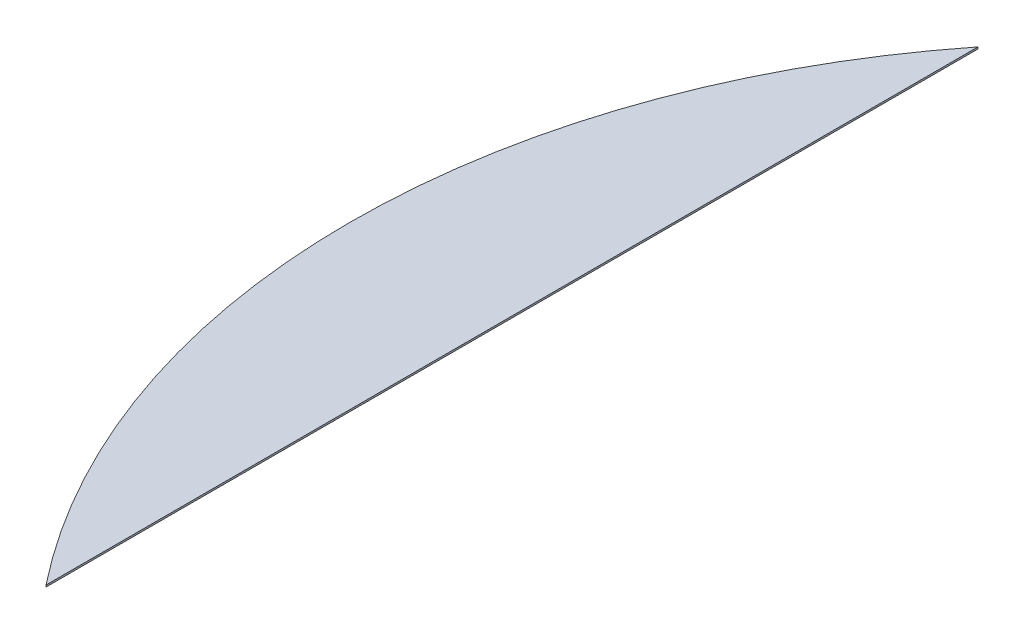
ISO-10303-21;
HEADER;
FILE_DESCRIPTION(('STEP AP214'),'2;1');
FILE_NAME('part.step','',(''),(''),'','','');
FILE_SCHEMA(('AUTOMOTIVE_DESIGN { 1 0 10303 214 1 1 1 1 }'));
ENDSEC;
DATA;
#1=APPLICATION_CONTEXT('core data for automotive mechanical design processes');
#2=APPLICATION_PROTOCOL_DEFINITION('international standard','automotive_design',2000,#1);
#3=PRODUCT_CONTEXT('',#1,'mechanical');
#4=PRODUCT('Part','Part','',(#3));
#5=PRODUCT_RELATED_PRODUCT_CATEGORY('part','',(#4));
#6=PRODUCT_DEFINITION_FORMATION('','',#4);
#7=PRODUCT_DEFINITION_CONTEXT('part definition',#1,'design');
#8=PRODUCT_DEFINITION('design','',#6,#7);
#9=PRODUCT_DEFINITION_SHAPE('','',#8);
#10=(LENGTH_UNIT() NAMED_UNIT(*) SI_UNIT(.MILLI.,.METRE.));
#11=(NAMED_UNIT(*) PLANE_ANGLE_UNIT() SI_UNIT($,.RADIAN.));
#12=(NAMED_UNIT(*) SI_UNIT($,.STERADIAN.) SOLID_ANGLE_UNIT());
#13=UNCERTAINTY_MEASURE_WITH_UNIT(LENGTH_MEASURE(1.E-05),#10,'distance_accuracy_value','');
#14=(GEOMETRIC_REPRESENTATION_CONTEXT(3) GLOBAL_UNCERTAINTY_ASSIGNED_CONTEXT((#13)) GLOBAL_UNIT_ASSIGNED_CONTEXT((#10,
#11,#12)) REPRESENTATION_CONTEXT('',''));
#15=CARTESIAN_POINT('',(0.,0.,0.));
#16=DIRECTION('',(0.,0.,1.));
#17=DIRECTION('',(1.,0.,0.));
#18=AXIS2_PLACEMENT_3D('',#15,#16,#17);
#19=CARTESIAN_POINT('',(0.,1095.,0.));
#20=DIRECTION('',(0.,-1.,0.));
#21=DIRECTION('',(0.,0.,-1.));
#22=AXIS2_PLACEMENT_3D('',#19,#20,#21);
#23=CYLINDRICAL_SURFACE('',#22,824.);
#24=CARTESIAN_POINT('',(0.,1093.,0.));
#25=DIRECTION('',(0.,1.,0.));
#26=DIRECTION('',(0.,0.,1.));
#27=AXIS2_PLACEMENT_3D('',#24,#25,#26);
#28=CIRCLE('',#27,824.);
#29=CARTESIAN_POINT('',(-646.,1093.,-511.527125380463));
#30=VERTEX_POINT('',#29);
#31=CARTESIAN_POINT('',(-646.,1093.,511.527125380463));
#32=VERTEX_POINT('',#31);
#33=EDGE_CURVE('E73',#30,#32,#28,.T.);
#34=ORIENTED_EDGE('',*,*,#33,.T.);
#35=DIRECTION('',(0.,-1.,0.));
#36=VECTOR('',#35,1.);
#37=CARTESIAN_POINT('',(-646.,1095.,511.527125380463));
#38=LINE('',#37,#36);
#39=CARTESIAN_POINT('',(-646.,1095.,511.527125380463));
#40=VERTEX_POINT('',#39);
#41=EDGE_CURVE('E11',#40,#32,#38,.T.);
#42=ORIENTED_EDGE('',*,*,#41,.F.);
#43=CARTESIAN_POINT('',(0.,1095.,0.));
#44=DIRECTION('',(0.,1.,0.));
#45=DIRECTION('',(0.,0.,1.));
#46=AXIS2_PLACEMENT_3D('',#43,#44,#45);
#47=CIRCLE('',#46,824.);
#48=CARTESIAN_POINT('',(-646.,1095.,-511.527125380463));
#49=VERTEX_POINT('',#48);
#50=EDGE_CURVE('E72',#49,#40,#47,.T.);
#51=ORIENTED_EDGE('',*,*,#50,.F.);
#52=DIRECTION('',(0.,-1.,0.));
#53=VECTOR('',#52,1.);
#54=CARTESIAN_POINT('',(-646.,1095.,-511.527125380463));
#55=LINE('',#54,#53);
#56=EDGE_CURVE('E49',#49,#30,#55,.T.);
#57=ORIENTED_EDGE('',*,*,#56,.T.);
#58=EDGE_LOOP('',(#34,#42,#51,#57));
#59=FACE_BOUND('',#58,.T.);
#60=ADVANCED_FACE('F40',(#59),#23,.T.);
#61=CARTESIAN_POINT('',(-646.,1095.,-511.527125380463));
#62=DIRECTION('',(-1.,0.,0.));
#63=DIRECTION('',(0.,0.,1.));
#64=AXIS2_PLACEMENT_3D('',#61,#62,#63);
#65=PLANE('',#64);
#66=DIRECTION('',(0.,0.,-1.));
#67=VECTOR('',#66,1.);
#68=CARTESIAN_POINT('',(-646.,1093.,-511.527125380463));
#69=LINE('',#68,#67);
#70=EDGE_CURVE('E64',#32,#30,#69,.T.);
#71=ORIENTED_EDGE('',*,*,#70,.T.);
#72=ORIENTED_EDGE('',*,*,#56,.F.);
#73=DIRECTION('',(0.,0.,-1.));
#74=VECTOR('',#73,1.);
#75=CARTESIAN_POINT('',(-646.,1095.,-511.527125380463));
#76=LINE('',#75,#74);
#77=EDGE_CURVE('E56',#40,#49,#76,.T.);
#78=ORIENTED_EDGE('',*,*,#77,.F.);
#79=ORIENTED_EDGE('',*,*,#41,.T.);
#80=EDGE_LOOP('',(#71,#72,#78,#79));
#81=FACE_BOUND('',#80,.T.);
#82=ADVANCED_FACE('F67',(#81),#65,.F.);
#83=CARTESIAN_POINT('',(0.,1095.,0.));
#84=DIRECTION('',(0.,1.,0.));
#85=DIRECTION('',(0.,0.,1.));
#86=AXIS2_PLACEMENT_3D('',#83,#84,#85);
#87=PLANE('',#86);
#88=ORIENTED_EDGE('',*,*,#50,.T.);
#89=ORIENTED_EDGE('',*,*,#77,.T.);
#90=EDGE_LOOP('',(#88,#89));
#91=FACE_BOUND('',#90,.T.);
#92=ADVANCED_FACE('F86',(#91),#87,.T.);
#93=CARTESIAN_POINT('',(0.,1093.,0.));
#94=DIRECTION('',(0.,1.,0.));
#95=DIRECTION('',(0.,0.,1.));
#96=AXIS2_PLACEMENT_3D('',#93,#94,#95);
#97=PLANE('',#96);
#98=ORIENTED_EDGE('',*,*,#33,.F.);
#99=ORIENTED_EDGE('',*,*,#70,.F.);
#100=EDGE_LOOP('',(#98,#99));
#101=FACE_BOUND('',#100,.T.);
#102=ADVANCED_FACE('F77',(#101),#97,.F.);
#103=CLOSED_SHELL('',(#60,#82,#92,#102));
#104=MANIFOLD_SOLID_BREP('B2',#103);
#105=ADVANCED_BREP_SHAPE_REPRESENTATION('',(#18,#104),#14);
#106=SHAPE_DEFINITION_REPRESENTATION(#9,#105);
ENDSEC;
END-ISO-10303-21;
